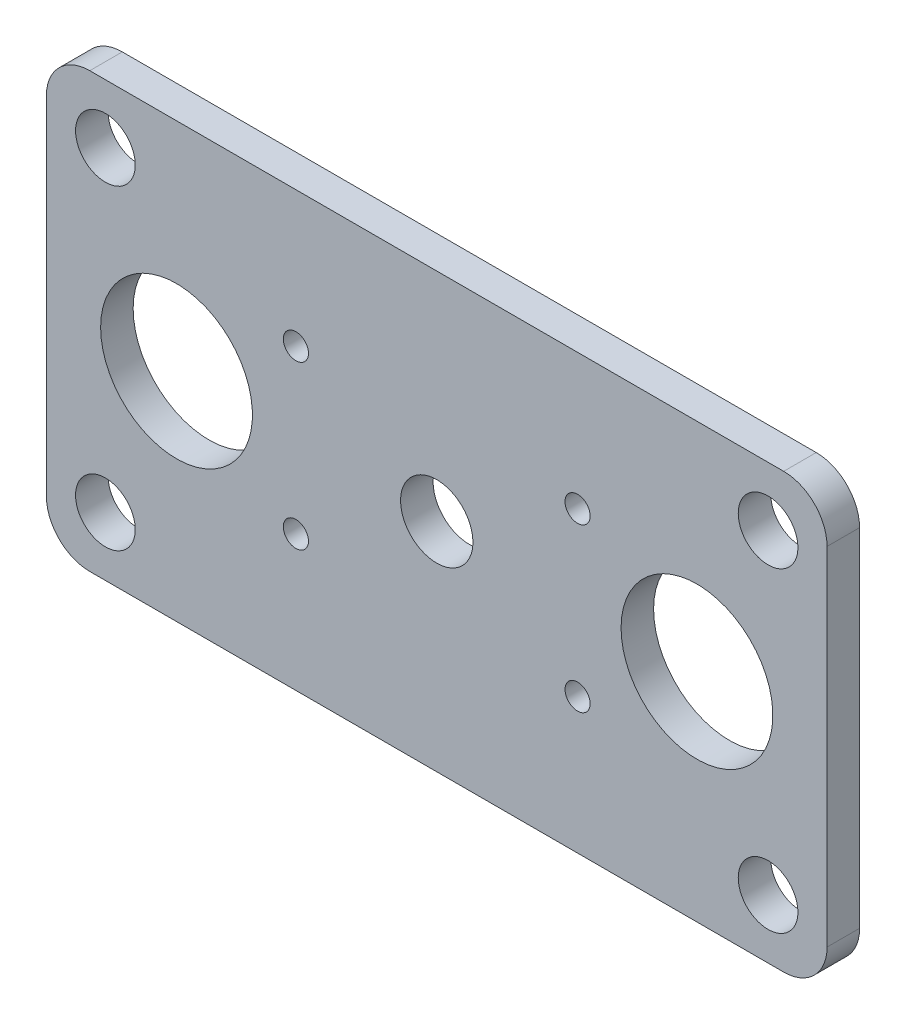
ISO-10303-21;
HEADER;
FILE_DESCRIPTION(('STEP AP214'),'2;1');
FILE_NAME('part.step','',(''),(''),'','','');
FILE_SCHEMA(('AUTOMOTIVE_DESIGN { 1 0 10303 214 1 1 1 1 }'));
ENDSEC;
DATA;
#1=APPLICATION_CONTEXT('core data for automotive mechanical design processes');
#2=APPLICATION_PROTOCOL_DEFINITION('international standard','automotive_design',2000,#1);
#3=PRODUCT_CONTEXT('',#1,'mechanical');
#4=PRODUCT('Part','Part','',(#3));
#5=PRODUCT_RELATED_PRODUCT_CATEGORY('part','',(#4));
#6=PRODUCT_DEFINITION_FORMATION('','',#4);
#7=PRODUCT_DEFINITION_CONTEXT('part definition',#1,'design');
#8=PRODUCT_DEFINITION('design','',#6,#7);
#9=PRODUCT_DEFINITION_SHAPE('','',#8);
#10=(LENGTH_UNIT() NAMED_UNIT(*) SI_UNIT(.MILLI.,.METRE.));
#11=(NAMED_UNIT(*) PLANE_ANGLE_UNIT() SI_UNIT($,.RADIAN.));
#12=(NAMED_UNIT(*) SI_UNIT($,.STERADIAN.) SOLID_ANGLE_UNIT());
#13=UNCERTAINTY_MEASURE_WITH_UNIT(LENGTH_MEASURE(1.E-05),#10,'distance_accuracy_value','');
#14=(GEOMETRIC_REPRESENTATION_CONTEXT(3) GLOBAL_UNCERTAINTY_ASSIGNED_CONTEXT((#13)) GLOBAL_UNIT_ASSIGNED_CONTEXT((#10,
#11,#12)) REPRESENTATION_CONTEXT('',''));
#15=CARTESIAN_POINT('',(0.,0.,0.));
#16=DIRECTION('',(0.,0.,1.));
#17=DIRECTION('',(1.,0.,0.));
#18=AXIS2_PLACEMENT_3D('',#15,#16,#17);
#19=CARTESIAN_POINT('',(0.,0.,4.7625));
#20=DIRECTION('',(0.,0.,1.));
#21=DIRECTION('',(1.,0.,0.));
#22=AXIS2_PLACEMENT_3D('',#19,#20,#21);
#23=PLANE('',#22);
#24=CARTESIAN_POINT('',(-20.6222299276169,11.90625,4.7625));
#25=DIRECTION('',(0.,0.,-1.));
#26=DIRECTION('',(-1.,0.,0.));
#27=AXIS2_PLACEMENT_3D('',#24,#25,#26);
#28=CIRCLE('',#27,1.8415);
#29=CARTESIAN_POINT('',(-22.4637299276169,11.90625,4.7625));
#30=VERTEX_POINT('',#29);
#31=EDGE_CURVE('E160',#30,#30,#28,.T.);
#32=ORIENTED_EDGE('',*,*,#31,.T.);
#33=EDGE_LOOP('',(#32));
#34=FACE_BOUND('',#33,.T.);
#35=CARTESIAN_POINT('',(-20.6222299276169,-11.90625,4.7625));
#36=DIRECTION('',(0.,0.,-1.));
#37=DIRECTION('',(-1.,0.,0.));
#38=AXIS2_PLACEMENT_3D('',#35,#36,#37);
#39=CIRCLE('',#38,1.8415);
#40=CARTESIAN_POINT('',(-22.4637299276169,-11.90625,4.7625));
#41=VERTEX_POINT('',#40);
#42=EDGE_CURVE('E163',#41,#41,#39,.T.);
#43=ORIENTED_EDGE('',*,*,#42,.T.);
#44=EDGE_LOOP('',(#43));
#45=FACE_BOUND('',#44,.T.);
#46=CARTESIAN_POINT('',(20.6222299276169,-11.90625,4.7625));
#47=DIRECTION('',(0.,0.,-1.));
#48=DIRECTION('',(-1.,0.,0.));
#49=AXIS2_PLACEMENT_3D('',#46,#47,#48);
#50=CIRCLE('',#49,1.84149999999999);
#51=CARTESIAN_POINT('',(18.780729927617,-11.90625,4.7625));
#52=VERTEX_POINT('',#51);
#53=EDGE_CURVE('E166',#52,#52,#50,.T.);
#54=ORIENTED_EDGE('',*,*,#53,.T.);
#55=EDGE_LOOP('',(#54));
#56=FACE_BOUND('',#55,.T.);
#57=CARTESIAN_POINT('',(20.622229927617,11.90625,4.7625));
#58=DIRECTION('',(0.,0.,-1.));
#59=DIRECTION('',(-1.,0.,0.));
#60=AXIS2_PLACEMENT_3D('',#57,#58,#59);
#61=CIRCLE('',#60,1.8415);
#62=CARTESIAN_POINT('',(18.780729927617,11.90625,4.7625));
#63=VERTEX_POINT('',#62);
#64=EDGE_CURVE('E169',#63,#63,#61,.T.);
#65=ORIENTED_EDGE('',*,*,#64,.T.);
#66=EDGE_LOOP('',(#65));
#67=FACE_BOUND('',#66,.T.);
#68=CARTESIAN_POINT('',(-38.1,0.,4.7625));
#69=DIRECTION('',(0.,0.,-1.));
#70=DIRECTION('',(-1.,0.,0.));
#71=AXIS2_PLACEMENT_3D('',#68,#69,#70);
#72=CIRCLE('',#71,11.1125);
#73=CARTESIAN_POINT('',(-49.2125,0.,4.7625));
#74=VERTEX_POINT('',#73);
#75=EDGE_CURVE('E172',#74,#74,#72,.T.);
#76=ORIENTED_EDGE('',*,*,#75,.T.);
#77=EDGE_LOOP('',(#76));
#78=FACE_BOUND('',#77,.T.);
#79=CARTESIAN_POINT('',(38.1,0.,4.7625));
#80=DIRECTION('',(0.,0.,-1.));
#81=DIRECTION('',(-1.,0.,0.));
#82=AXIS2_PLACEMENT_3D('',#79,#80,#81);
#83=CIRCLE('',#82,11.1125);
#84=CARTESIAN_POINT('',(26.9875,0.,4.7625));
#85=VERTEX_POINT('',#84);
#86=EDGE_CURVE('E175',#85,#85,#83,.T.);
#87=ORIENTED_EDGE('',*,*,#86,.T.);
#88=EDGE_LOOP('',(#87));
#89=FACE_BOUND('',#88,.T.);
#90=CARTESIAN_POINT('',(48.514,-23.1140000000001,4.7625));
#91=DIRECTION('',(0.,0.,-1.));
#92=DIRECTION('',(-1.,0.,0.));
#93=AXIS2_PLACEMENT_3D('',#90,#91,#92);
#94=CIRCLE('',#93,4.36880000000001);
#95=CARTESIAN_POINT('',(44.1452,-23.1140000000001,4.7625));
#96=VERTEX_POINT('',#95);
#97=EDGE_CURVE('E178',#96,#96,#94,.T.);
#98=ORIENTED_EDGE('',*,*,#97,.T.);
#99=EDGE_LOOP('',(#98));
#100=FACE_BOUND('',#99,.T.);
#101=CARTESIAN_POINT('',(48.514,23.1140000000001,4.7625));
#102=DIRECTION('',(0.,0.,-1.));
#103=DIRECTION('',(-1.,0.,0.));
#104=AXIS2_PLACEMENT_3D('',#101,#102,#103);
#105=CIRCLE('',#104,4.3688);
#106=CARTESIAN_POINT('',(44.1452,23.1140000000001,4.7625));
#107=VERTEX_POINT('',#106);
#108=EDGE_CURVE('E181',#107,#107,#105,.T.);
#109=ORIENTED_EDGE('',*,*,#108,.T.);
#110=EDGE_LOOP('',(#109));
#111=FACE_BOUND('',#110,.T.);
#112=CARTESIAN_POINT('',(-48.514,-23.114,4.7625));
#113=DIRECTION('',(0.,0.,-1.));
#114=DIRECTION('',(-1.,0.,0.));
#115=AXIS2_PLACEMENT_3D('',#112,#113,#114);
#116=CIRCLE('',#115,4.3688);
#117=CARTESIAN_POINT('',(-52.8828,-23.114,4.7625));
#118=VERTEX_POINT('',#117);
#119=EDGE_CURVE('E184',#118,#118,#116,.T.);
#120=ORIENTED_EDGE('',*,*,#119,.T.);
#121=EDGE_LOOP('',(#120));
#122=FACE_BOUND('',#121,.T.);
#123=CARTESIAN_POINT('',(-48.514,23.114,4.7625));
#124=DIRECTION('',(0.,0.,-1.));
#125=DIRECTION('',(-1.,0.,0.));
#126=AXIS2_PLACEMENT_3D('',#123,#124,#125);
#127=CIRCLE('',#126,4.36880000000001);
#128=CARTESIAN_POINT('',(-52.8828,23.114,4.7625));
#129=VERTEX_POINT('',#128);
#130=EDGE_CURVE('E187',#129,#129,#127,.T.);
#131=ORIENTED_EDGE('',*,*,#130,.T.);
#132=EDGE_LOOP('',(#131));
#133=FACE_BOUND('',#132,.T.);
#134=CARTESIAN_POINT('',(0.,0.,4.7625));
#135=DIRECTION('',(0.,0.,-1.));
#136=DIRECTION('',(-1.,0.,0.));
#137=AXIS2_PLACEMENT_3D('',#134,#135,#136);
#138=CIRCLE('',#137,5.2959);
#139=CARTESIAN_POINT('',(-5.2959,0.,4.7625));
#140=VERTEX_POINT('',#139);
#141=EDGE_CURVE('E190',#140,#140,#138,.T.);
#142=ORIENTED_EDGE('',*,*,#141,.T.);
#143=EDGE_LOOP('',(#142));
#144=FACE_BOUND('',#143,.T.);
#145=DIRECTION('',(0.,1.,0.));
#146=VECTOR('',#145,1.);
#147=CARTESIAN_POINT('',(57.15,25.4,4.7625));
#148=LINE('',#147,#146);
#149=CARTESIAN_POINT('',(57.15,25.4,4.7625));
#150=VERTEX_POINT('',#149);
#151=CARTESIAN_POINT('',(57.15,-25.4,4.7625));
#152=VERTEX_POINT('',#151);
#153=EDGE_CURVE('E114',#150,#152,#148,.F.);
#154=ORIENTED_EDGE('',*,*,#153,.F.);
#155=CARTESIAN_POINT('',(50.8,25.4,4.7625));
#156=DIRECTION('',(0.,0.,1.));
#157=DIRECTION('',(1.,0.,0.));
#158=AXIS2_PLACEMENT_3D('',#155,#156,#157);
#159=CIRCLE('',#158,6.35);
#160=CARTESIAN_POINT('',(50.8,31.75,4.7625));
#161=VERTEX_POINT('',#160);
#162=EDGE_CURVE('E195',#161,#150,#159,.F.);
#163=ORIENTED_EDGE('',*,*,#162,.F.);
#164=DIRECTION('',(1.,0.,0.));
#165=VECTOR('',#164,1.);
#166=CARTESIAN_POINT('',(21.0605674187569,31.75,4.7625));
#167=LINE('',#166,#165);
#168=CARTESIAN_POINT('',(-50.8,31.75,4.7625));
#169=VERTEX_POINT('',#168);
#170=EDGE_CURVE('E110',#169,#161,#167,.T.);
#171=ORIENTED_EDGE('',*,*,#170,.F.);
#172=CARTESIAN_POINT('',(-50.8,25.4,4.7625));
#173=DIRECTION('',(0.,0.,1.));
#174=DIRECTION('',(1.,0.,0.));
#175=AXIS2_PLACEMENT_3D('',#172,#173,#174);
#176=CIRCLE('',#175,6.35);
#177=CARTESIAN_POINT('',(-57.15,25.4,4.7625));
#178=VERTEX_POINT('',#177);
#179=EDGE_CURVE('E97',#178,#169,#176,.F.);
#180=ORIENTED_EDGE('',*,*,#179,.F.);
#181=DIRECTION('',(0.,1.,0.));
#182=VECTOR('',#181,1.);
#183=CARTESIAN_POINT('',(-57.15,-25.4,4.7625));
#184=LINE('',#183,#182);
#185=CARTESIAN_POINT('',(-57.15,-25.4,4.7625));
#186=VERTEX_POINT('',#185);
#187=EDGE_CURVE('E93',#186,#178,#184,.T.);
#188=ORIENTED_EDGE('',*,*,#187,.F.);
#189=CARTESIAN_POINT('',(-50.8,-25.4,4.7625));
#190=DIRECTION('',(0.,0.,1.));
#191=DIRECTION('',(1.,0.,0.));
#192=AXIS2_PLACEMENT_3D('',#189,#190,#191);
#193=CIRCLE('',#192,6.35);
#194=CARTESIAN_POINT('',(-50.8,-31.7500000000001,4.7625));
#195=VERTEX_POINT('',#194);
#196=EDGE_CURVE('E21',#195,#186,#193,.F.);
#197=ORIENTED_EDGE('',*,*,#196,.F.);
#198=DIRECTION('',(1.,0.,0.));
#199=VECTOR('',#198,1.);
#200=CARTESIAN_POINT('',(21.0605674187567,-31.7500000000001,4.7625));
#201=LINE('',#200,#199);
#202=CARTESIAN_POINT('',(50.8,-31.75,4.7625));
#203=VERTEX_POINT('',#202);
#204=EDGE_CURVE('E80',#203,#195,#201,.F.);
#205=ORIENTED_EDGE('',*,*,#204,.F.);
#206=CARTESIAN_POINT('',(50.8,-25.4,4.7625));
#207=DIRECTION('',(0.,0.,1.));
#208=DIRECTION('',(1.,0.,0.));
#209=AXIS2_PLACEMENT_3D('',#206,#207,#208);
#210=CIRCLE('',#209,6.35);
#211=EDGE_CURVE('E196',#152,#203,#210,.F.);
#212=ORIENTED_EDGE('',*,*,#211,.F.);
#213=EDGE_LOOP('',(#154,#163,#171,#180,#188,#197,#205,#212));
#214=FACE_BOUND('',#213,.T.);
#215=ADVANCED_FACE('F17',(#34,#45,#56,#67,#78,#89,#100,#111,#122,#133,#144,#214),#23,.T.);
#216=CARTESIAN_POINT('',(-57.15,-25.4,0.));
#217=DIRECTION('',(-1.,0.,0.));
#218=DIRECTION('',(0.,0.,1.));
#219=AXIS2_PLACEMENT_3D('',#216,#217,#218);
#220=PLANE('',#219);
#221=DIRECTION('',(0.,1.,0.));
#222=VECTOR('',#221,1.);
#223=CARTESIAN_POINT('',(-57.15,0.,0.));
#224=LINE('',#223,#222);
#225=CARTESIAN_POINT('',(-57.15,25.4,0.));
#226=VERTEX_POINT('',#225);
#227=CARTESIAN_POINT('',(-57.15,-25.4,0.));
#228=VERTEX_POINT('',#227);
#229=EDGE_CURVE('E104',#226,#228,#224,.F.);
#230=ORIENTED_EDGE('',*,*,#229,.T.);
#231=DIRECTION('',(0.,0.,1.));
#232=VECTOR('',#231,1.);
#233=CARTESIAN_POINT('',(-57.15,-25.4,0.));
#234=LINE('',#233,#232);
#235=EDGE_CURVE('E89',#186,#228,#234,.F.);
#236=ORIENTED_EDGE('',*,*,#235,.F.);
#237=ORIENTED_EDGE('',*,*,#187,.T.);
#238=DIRECTION('',(0.,0.,1.));
#239=VECTOR('',#238,1.);
#240=CARTESIAN_POINT('',(-57.15,25.4,0.));
#241=LINE('',#240,#239);
#242=EDGE_CURVE('E193',#226,#178,#241,.T.);
#243=ORIENTED_EDGE('',*,*,#242,.F.);
#244=EDGE_LOOP('',(#230,#236,#237,#243));
#245=FACE_BOUND('',#244,.T.);
#246=ADVANCED_FACE('F103',(#245),#220,.T.);
#247=CARTESIAN_POINT('',(-50.8,-25.4,0.));
#248=DIRECTION('',(0.,0.,1.));
#249=DIRECTION('',(1.,0.,0.));
#250=AXIS2_PLACEMENT_3D('',#247,#248,#249);
#251=CYLINDRICAL_SURFACE('',#250,6.35);
#252=CARTESIAN_POINT('',(-50.8,-25.4,0.));
#253=DIRECTION('',(0.,0.,1.));
#254=DIRECTION('',(1.,0.,0.));
#255=AXIS2_PLACEMENT_3D('',#252,#253,#254);
#256=CIRCLE('',#255,6.35);
#257=CARTESIAN_POINT('',(-50.8,-31.75,0.));
#258=VERTEX_POINT('',#257);
#259=EDGE_CURVE('E158',#228,#258,#256,.T.);
#260=ORIENTED_EDGE('',*,*,#259,.T.);
#261=DIRECTION('',(0.,0.,-1.));
#262=VECTOR('',#261,1.);
#263=CARTESIAN_POINT('',(-50.8,-31.7500000000001,0.));
#264=LINE('',#263,#262);
#265=EDGE_CURVE('E91',#195,#258,#264,.T.);
#266=ORIENTED_EDGE('',*,*,#265,.F.);
#267=ORIENTED_EDGE('',*,*,#196,.T.);
#268=ORIENTED_EDGE('',*,*,#235,.T.);
#269=EDGE_LOOP('',(#260,#266,#267,#268));
#270=FACE_BOUND('',#269,.T.);
#271=ADVANCED_FACE('F87',(#270),#251,.T.);
#272=CARTESIAN_POINT('',(21.0605674187567,-31.7500000000001,0.));
#273=DIRECTION('',(0.,-1.,0.));
#274=DIRECTION('',(0.,0.,-1.));
#275=AXIS2_PLACEMENT_3D('',#272,#273,#274);
#276=PLANE('',#275);
#277=DIRECTION('',(1.,0.,0.));
#278=VECTOR('',#277,1.);
#279=CARTESIAN_POINT('',(0.,-31.75,0.));
#280=LINE('',#279,#278);
#281=CARTESIAN_POINT('',(50.8,-31.75,0.));
#282=VERTEX_POINT('',#281);
#283=EDGE_CURVE('E157',#258,#282,#280,.T.);
#284=ORIENTED_EDGE('',*,*,#283,.T.);
#285=DIRECTION('',(0.,0.,1.));
#286=VECTOR('',#285,1.);
#287=CARTESIAN_POINT('',(50.8,-31.75,0.));
#288=LINE('',#287,#286);
#289=EDGE_CURVE('E116',#203,#282,#288,.F.);
#290=ORIENTED_EDGE('',*,*,#289,.F.);
#291=ORIENTED_EDGE('',*,*,#204,.T.);
#292=ORIENTED_EDGE('',*,*,#265,.T.);
#293=EDGE_LOOP('',(#284,#290,#291,#292));
#294=FACE_BOUND('',#293,.T.);
#295=ADVANCED_FACE('F202',(#294),#276,.T.);
#296=CARTESIAN_POINT('',(50.8,-25.4,0.));
#297=DIRECTION('',(0.,0.,1.));
#298=DIRECTION('',(1.,0.,0.));
#299=AXIS2_PLACEMENT_3D('',#296,#297,#298);
#300=CYLINDRICAL_SURFACE('',#299,6.35);
#301=CARTESIAN_POINT('',(50.8,-25.4,0.));
#302=DIRECTION('',(0.,0.,1.));
#303=DIRECTION('',(1.,0.,0.));
#304=AXIS2_PLACEMENT_3D('',#301,#302,#303);
#305=CIRCLE('',#304,6.35);
#306=CARTESIAN_POINT('',(57.15,-25.4,0.));
#307=VERTEX_POINT('',#306);
#308=EDGE_CURVE('E154',#282,#307,#305,.T.);
#309=ORIENTED_EDGE('',*,*,#308,.T.);
#310=DIRECTION('',(0.,0.,-1.));
#311=VECTOR('',#310,1.);
#312=CARTESIAN_POINT('',(57.15,-25.4,0.));
#313=LINE('',#312,#311);
#314=EDGE_CURVE('E115',#152,#307,#313,.T.);
#315=ORIENTED_EDGE('',*,*,#314,.F.);
#316=ORIENTED_EDGE('',*,*,#211,.T.);
#317=ORIENTED_EDGE('',*,*,#289,.T.);
#318=EDGE_LOOP('',(#309,#315,#316,#317));
#319=FACE_BOUND('',#318,.T.);
#320=ADVANCED_FACE('F222',(#319),#300,.T.);
#321=CARTESIAN_POINT('',(57.15,25.4,0.));
#322=DIRECTION('',(1.,0.,0.));
#323=DIRECTION('',(0.,0.,-1.));
#324=AXIS2_PLACEMENT_3D('',#321,#322,#323);
#325=PLANE('',#324);
#326=DIRECTION('',(0.,1.,0.));
#327=VECTOR('',#326,1.);
#328=CARTESIAN_POINT('',(57.15,0.,0.));
#329=LINE('',#328,#327);
#330=CARTESIAN_POINT('',(57.15,25.4,0.));
#331=VERTEX_POINT('',#330);
#332=EDGE_CURVE('E153',#307,#331,#329,.T.);
#333=ORIENTED_EDGE('',*,*,#332,.T.);
#334=DIRECTION('',(0.,0.,1.));
#335=VECTOR('',#334,1.);
#336=CARTESIAN_POINT('',(57.15,25.4,0.));
#337=LINE('',#336,#335);
#338=EDGE_CURVE('E113',#150,#331,#337,.F.);
#339=ORIENTED_EDGE('',*,*,#338,.F.);
#340=ORIENTED_EDGE('',*,*,#153,.T.);
#341=ORIENTED_EDGE('',*,*,#314,.T.);
#342=EDGE_LOOP('',(#333,#339,#340,#341));
#343=FACE_BOUND('',#342,.T.);
#344=ADVANCED_FACE('F219',(#343),#325,.T.);
#345=CARTESIAN_POINT('',(50.8,25.4,0.));
#346=DIRECTION('',(0.,0.,1.));
#347=DIRECTION('',(1.,0.,0.));
#348=AXIS2_PLACEMENT_3D('',#345,#346,#347);
#349=CYLINDRICAL_SURFACE('',#348,6.35);
#350=CARTESIAN_POINT('',(50.8,25.4,0.));
#351=DIRECTION('',(0.,0.,1.));
#352=DIRECTION('',(1.,0.,0.));
#353=AXIS2_PLACEMENT_3D('',#350,#351,#352);
#354=CIRCLE('',#353,6.35);
#355=CARTESIAN_POINT('',(50.8,31.75,0.));
#356=VERTEX_POINT('',#355);
#357=EDGE_CURVE('E150',#331,#356,#354,.T.);
#358=ORIENTED_EDGE('',*,*,#357,.T.);
#359=DIRECTION('',(0.,0.,1.));
#360=VECTOR('',#359,1.);
#361=CARTESIAN_POINT('',(50.8,31.75,0.));
#362=LINE('',#361,#360);
#363=EDGE_CURVE('E112',#161,#356,#362,.F.);
#364=ORIENTED_EDGE('',*,*,#363,.F.);
#365=ORIENTED_EDGE('',*,*,#162,.T.);
#366=ORIENTED_EDGE('',*,*,#338,.T.);
#367=EDGE_LOOP('',(#358,#364,#365,#366));
#368=FACE_BOUND('',#367,.T.);
#369=ADVANCED_FACE('F230',(#368),#349,.T.);
#370=CARTESIAN_POINT('',(21.0605674187569,31.75,0.));
#371=DIRECTION('',(0.,1.,0.));
#372=DIRECTION('',(0.,0.,1.));
#373=AXIS2_PLACEMENT_3D('',#370,#371,#372);
#374=PLANE('',#373);
#375=DIRECTION('',(1.,0.,0.));
#376=VECTOR('',#375,1.);
#377=CARTESIAN_POINT('',(0.,31.75,0.));
#378=LINE('',#377,#376);
#379=CARTESIAN_POINT('',(-50.8,31.75,0.));
#380=VERTEX_POINT('',#379);
#381=EDGE_CURVE('E149',#356,#380,#378,.F.);
#382=ORIENTED_EDGE('',*,*,#381,.T.);
#383=DIRECTION('',(0.,0.,1.));
#384=VECTOR('',#383,1.);
#385=CARTESIAN_POINT('',(-50.8,31.75,0.));
#386=LINE('',#385,#384);
#387=EDGE_CURVE('E36',#169,#380,#386,.F.);
#388=ORIENTED_EDGE('',*,*,#387,.F.);
#389=ORIENTED_EDGE('',*,*,#170,.T.);
#390=ORIENTED_EDGE('',*,*,#363,.T.);
#391=EDGE_LOOP('',(#382,#388,#389,#390));
#392=FACE_BOUND('',#391,.T.);
#393=ADVANCED_FACE('F258',(#392),#374,.T.);
#394=CARTESIAN_POINT('',(-50.8,25.4,0.));
#395=DIRECTION('',(0.,0.,1.));
#396=DIRECTION('',(1.,0.,0.));
#397=AXIS2_PLACEMENT_3D('',#394,#395,#396);
#398=CYLINDRICAL_SURFACE('',#397,6.35);
#399=CARTESIAN_POINT('',(-50.8,25.4,0.));
#400=DIRECTION('',(0.,0.,1.));
#401=DIRECTION('',(1.,0.,0.));
#402=AXIS2_PLACEMENT_3D('',#399,#400,#401);
#403=CIRCLE('',#402,6.35);
#404=EDGE_CURVE('E147',#380,#226,#403,.T.);
#405=ORIENTED_EDGE('',*,*,#404,.T.);
#406=ORIENTED_EDGE('',*,*,#242,.T.);
#407=ORIENTED_EDGE('',*,*,#179,.T.);
#408=ORIENTED_EDGE('',*,*,#387,.T.);
#409=EDGE_LOOP('',(#405,#406,#407,#408));
#410=FACE_BOUND('',#409,.T.);
#411=ADVANCED_FACE('F254',(#410),#398,.T.);
#412=CARTESIAN_POINT('',(0.,0.,4.7625));
#413=DIRECTION('',(0.,0.,-1.));
#414=DIRECTION('',(-1.,0.,0.));
#415=AXIS2_PLACEMENT_3D('',#412,#413,#414);
#416=CYLINDRICAL_SURFACE('',#415,5.2959);
#417=ORIENTED_EDGE('',*,*,#141,.F.);
#418=EDGE_LOOP('',(#417));
#419=FACE_BOUND('',#418,.T.);
#420=CARTESIAN_POINT('',(0.,0.,0.));
#421=DIRECTION('',(0.,0.,-1.));
#422=DIRECTION('',(-1.,0.,0.));
#423=AXIS2_PLACEMENT_3D('',#420,#421,#422);
#424=CIRCLE('',#423,5.2959);
#425=CARTESIAN_POINT('',(-5.2959,0.,0.));
#426=VERTEX_POINT('',#425);
#427=EDGE_CURVE('E144',#426,#426,#424,.T.);
#428=ORIENTED_EDGE('',*,*,#427,.T.);
#429=EDGE_LOOP('',(#428));
#430=FACE_BOUND('',#429,.T.);
#431=ADVANCED_FACE('F257',(#419,#430),#416,.F.);
#432=CARTESIAN_POINT('',(-48.514,23.114,4.7625));
#433=DIRECTION('',(0.,0.,-1.));
#434=DIRECTION('',(-1.,0.,0.));
#435=AXIS2_PLACEMENT_3D('',#432,#433,#434);
#436=CYLINDRICAL_SURFACE('',#435,4.36880000000001);
#437=ORIENTED_EDGE('',*,*,#130,.F.);
#438=EDGE_LOOP('',(#437));
#439=FACE_BOUND('',#438,.T.);
#440=CARTESIAN_POINT('',(-48.514,23.114,0.));
#441=DIRECTION('',(0.,0.,-1.));
#442=DIRECTION('',(-1.,0.,0.));
#443=AXIS2_PLACEMENT_3D('',#440,#441,#442);
#444=CIRCLE('',#443,4.36880000000001);
#445=CARTESIAN_POINT('',(-52.8828,23.114,0.));
#446=VERTEX_POINT('',#445);
#447=EDGE_CURVE('E141',#446,#446,#444,.T.);
#448=ORIENTED_EDGE('',*,*,#447,.T.);
#449=EDGE_LOOP('',(#448));
#450=FACE_BOUND('',#449,.T.);
#451=ADVANCED_FACE('F287',(#439,#450),#436,.F.);
#452=CARTESIAN_POINT('',(-48.514,-23.114,4.7625));
#453=DIRECTION('',(0.,0.,-1.));
#454=DIRECTION('',(-1.,0.,0.));
#455=AXIS2_PLACEMENT_3D('',#452,#453,#454);
#456=CYLINDRICAL_SURFACE('',#455,4.3688);
#457=ORIENTED_EDGE('',*,*,#119,.F.);
#458=EDGE_LOOP('',(#457));
#459=FACE_BOUND('',#458,.T.);
#460=CARTESIAN_POINT('',(-48.514,-23.114,0.));
#461=DIRECTION('',(0.,0.,-1.));
#462=DIRECTION('',(-1.,0.,0.));
#463=AXIS2_PLACEMENT_3D('',#460,#461,#462);
#464=CIRCLE('',#463,4.3688);
#465=CARTESIAN_POINT('',(-52.8828,-23.114,0.));
#466=VERTEX_POINT('',#465);
#467=EDGE_CURVE('E138',#466,#466,#464,.T.);
#468=ORIENTED_EDGE('',*,*,#467,.T.);
#469=EDGE_LOOP('',(#468));
#470=FACE_BOUND('',#469,.T.);
#471=ADVANCED_FACE('F295',(#459,#470),#456,.F.);
#472=CARTESIAN_POINT('',(48.514,23.1140000000001,4.7625));
#473=DIRECTION('',(0.,0.,-1.));
#474=DIRECTION('',(-1.,0.,0.));
#475=AXIS2_PLACEMENT_3D('',#472,#473,#474);
#476=CYLINDRICAL_SURFACE('',#475,4.3688);
#477=ORIENTED_EDGE('',*,*,#108,.F.);
#478=EDGE_LOOP('',(#477));
#479=FACE_BOUND('',#478,.T.);
#480=CARTESIAN_POINT('',(48.514,23.1140000000001,0.));
#481=DIRECTION('',(0.,0.,-1.));
#482=DIRECTION('',(-1.,0.,0.));
#483=AXIS2_PLACEMENT_3D('',#480,#481,#482);
#484=CIRCLE('',#483,4.3688);
#485=CARTESIAN_POINT('',(44.1452,23.1140000000001,0.));
#486=VERTEX_POINT('',#485);
#487=EDGE_CURVE('E135',#486,#486,#484,.T.);
#488=ORIENTED_EDGE('',*,*,#487,.T.);
#489=EDGE_LOOP('',(#488));
#490=FACE_BOUND('',#489,.T.);
#491=ADVANCED_FACE('F303',(#479,#490),#476,.F.);
#492=CARTESIAN_POINT('',(48.514,-23.1140000000001,4.7625));
#493=DIRECTION('',(0.,0.,-1.));
#494=DIRECTION('',(-1.,0.,0.));
#495=AXIS2_PLACEMENT_3D('',#492,#493,#494);
#496=CYLINDRICAL_SURFACE('',#495,4.36880000000001);
#497=ORIENTED_EDGE('',*,*,#97,.F.);
#498=EDGE_LOOP('',(#497));
#499=FACE_BOUND('',#498,.T.);
#500=CARTESIAN_POINT('',(48.514,-23.1140000000001,0.));
#501=DIRECTION('',(0.,0.,-1.));
#502=DIRECTION('',(-1.,0.,0.));
#503=AXIS2_PLACEMENT_3D('',#500,#501,#502);
#504=CIRCLE('',#503,4.36880000000001);
#505=CARTESIAN_POINT('',(44.1452,-23.1140000000001,0.));
#506=VERTEX_POINT('',#505);
#507=EDGE_CURVE('E132',#506,#506,#504,.T.);
#508=ORIENTED_EDGE('',*,*,#507,.T.);
#509=EDGE_LOOP('',(#508));
#510=FACE_BOUND('',#509,.T.);
#511=ADVANCED_FACE('F252',(#499,#510),#496,.F.);
#512=CARTESIAN_POINT('',(38.1,0.,4.7625));
#513=DIRECTION('',(0.,0.,-1.));
#514=DIRECTION('',(-1.,0.,0.));
#515=AXIS2_PLACEMENT_3D('',#512,#513,#514);
#516=CYLINDRICAL_SURFACE('',#515,11.1125);
#517=ORIENTED_EDGE('',*,*,#86,.F.);
#518=EDGE_LOOP('',(#517));
#519=FACE_BOUND('',#518,.T.);
#520=CARTESIAN_POINT('',(38.1,0.,0.));
#521=DIRECTION('',(0.,0.,-1.));
#522=DIRECTION('',(-1.,0.,0.));
#523=AXIS2_PLACEMENT_3D('',#520,#521,#522);
#524=CIRCLE('',#523,11.1125);
#525=CARTESIAN_POINT('',(26.9875,0.,0.));
#526=VERTEX_POINT('',#525);
#527=EDGE_CURVE('E129',#526,#526,#524,.T.);
#528=ORIENTED_EDGE('',*,*,#527,.T.);
#529=EDGE_LOOP('',(#528));
#530=FACE_BOUND('',#529,.T.);
#531=ADVANCED_FACE('F248',(#519,#530),#516,.F.);
#532=CARTESIAN_POINT('',(-38.1,0.,4.7625));
#533=DIRECTION('',(0.,0.,-1.));
#534=DIRECTION('',(-1.,0.,0.));
#535=AXIS2_PLACEMENT_3D('',#532,#533,#534);
#536=CYLINDRICAL_SURFACE('',#535,11.1125);
#537=ORIENTED_EDGE('',*,*,#75,.F.);
#538=EDGE_LOOP('',(#537));
#539=FACE_BOUND('',#538,.T.);
#540=CARTESIAN_POINT('',(-38.1,0.,0.));
#541=DIRECTION('',(0.,0.,-1.));
#542=DIRECTION('',(-1.,0.,0.));
#543=AXIS2_PLACEMENT_3D('',#540,#541,#542);
#544=CIRCLE('',#543,11.1125);
#545=CARTESIAN_POINT('',(-49.2125,0.,0.));
#546=VERTEX_POINT('',#545);
#547=EDGE_CURVE('E126',#546,#546,#544,.T.);
#548=ORIENTED_EDGE('',*,*,#547,.T.);
#549=EDGE_LOOP('',(#548));
#550=FACE_BOUND('',#549,.T.);
#551=ADVANCED_FACE('F244',(#539,#550),#536,.F.);
#552=CARTESIAN_POINT('',(20.622229927617,11.90625,4.7625));
#553=DIRECTION('',(0.,0.,-1.));
#554=DIRECTION('',(-1.,0.,0.));
#555=AXIS2_PLACEMENT_3D('',#552,#553,#554);
#556=CYLINDRICAL_SURFACE('',#555,1.8415);
#557=ORIENTED_EDGE('',*,*,#64,.F.);
#558=EDGE_LOOP('',(#557));
#559=FACE_BOUND('',#558,.T.);
#560=CARTESIAN_POINT('',(20.622229927617,11.90625,0.));
#561=DIRECTION('',(0.,0.,-1.));
#562=DIRECTION('',(-1.,0.,0.));
#563=AXIS2_PLACEMENT_3D('',#560,#561,#562);
#564=CIRCLE('',#563,1.8415);
#565=CARTESIAN_POINT('',(18.780729927617,11.90625,0.));
#566=VERTEX_POINT('',#565);
#567=EDGE_CURVE('E123',#566,#566,#564,.T.);
#568=ORIENTED_EDGE('',*,*,#567,.T.);
#569=EDGE_LOOP('',(#568));
#570=FACE_BOUND('',#569,.T.);
#571=ADVANCED_FACE('F247',(#559,#570),#556,.F.);
#572=CARTESIAN_POINT('',(20.6222299276169,-11.90625,4.7625));
#573=DIRECTION('',(0.,0.,-1.));
#574=DIRECTION('',(-1.,0.,0.));
#575=AXIS2_PLACEMENT_3D('',#572,#573,#574);
#576=CYLINDRICAL_SURFACE('',#575,1.84149999999999);
#577=ORIENTED_EDGE('',*,*,#53,.F.);
#578=EDGE_LOOP('',(#577));
#579=FACE_BOUND('',#578,.T.);
#580=CARTESIAN_POINT('',(20.6222299276169,-11.90625,0.));
#581=DIRECTION('',(0.,0.,-1.));
#582=DIRECTION('',(-1.,0.,0.));
#583=AXIS2_PLACEMENT_3D('',#580,#581,#582);
#584=CIRCLE('',#583,1.84149999999999);
#585=CARTESIAN_POINT('',(18.780729927617,-11.90625,0.));
#586=VERTEX_POINT('',#585);
#587=EDGE_CURVE('E120',#586,#586,#584,.T.);
#588=ORIENTED_EDGE('',*,*,#587,.T.);
#589=EDGE_LOOP('',(#588));
#590=FACE_BOUND('',#589,.T.);
#591=ADVANCED_FACE('F333',(#579,#590),#576,.F.);
#592=CARTESIAN_POINT('',(-20.6222299276169,-11.90625,4.7625));
#593=DIRECTION('',(0.,0.,-1.));
#594=DIRECTION('',(-1.,0.,0.));
#595=AXIS2_PLACEMENT_3D('',#592,#593,#594);
#596=CYLINDRICAL_SURFACE('',#595,1.8415);
#597=ORIENTED_EDGE('',*,*,#42,.F.);
#598=EDGE_LOOP('',(#597));
#599=FACE_BOUND('',#598,.T.);
#600=CARTESIAN_POINT('',(-20.6222299276169,-11.90625,0.));
#601=DIRECTION('',(0.,0.,-1.));
#602=DIRECTION('',(-1.,0.,0.));
#603=AXIS2_PLACEMENT_3D('',#600,#601,#602);
#604=CIRCLE('',#603,1.8415);
#605=CARTESIAN_POINT('',(-22.4637299276169,-11.90625,0.));
#606=VERTEX_POINT('',#605);
#607=EDGE_CURVE('E27',#606,#606,#604,.T.);
#608=ORIENTED_EDGE('',*,*,#607,.T.);
#609=EDGE_LOOP('',(#608));
#610=FACE_BOUND('',#609,.T.);
#611=ADVANCED_FACE('F239',(#599,#610),#596,.F.);
#612=CARTESIAN_POINT('',(-20.6222299276169,11.90625,4.7625));
#613=DIRECTION('',(0.,0.,-1.));
#614=DIRECTION('',(-1.,0.,0.));
#615=AXIS2_PLACEMENT_3D('',#612,#613,#614);
#616=CYLINDRICAL_SURFACE('',#615,1.8415);
#617=ORIENTED_EDGE('',*,*,#31,.F.);
#618=EDGE_LOOP('',(#617));
#619=FACE_BOUND('',#618,.T.);
#620=CARTESIAN_POINT('',(-20.6222299276169,11.90625,0.));
#621=DIRECTION('',(0.,0.,-1.));
#622=DIRECTION('',(-1.,0.,0.));
#623=AXIS2_PLACEMENT_3D('',#620,#621,#622);
#624=CIRCLE('',#623,1.8415);
#625=CARTESIAN_POINT('',(-22.4637299276169,11.90625,0.));
#626=VERTEX_POINT('',#625);
#627=EDGE_CURVE('E11',#626,#626,#624,.T.);
#628=ORIENTED_EDGE('',*,*,#627,.T.);
#629=EDGE_LOOP('',(#628));
#630=FACE_BOUND('',#629,.T.);
#631=ADVANCED_FACE('F19',(#619,#630),#616,.F.);
#632=CARTESIAN_POINT('',(0.,0.,0.));
#633=DIRECTION('',(0.,0.,1.));
#634=DIRECTION('',(1.,0.,0.));
#635=AXIS2_PLACEMENT_3D('',#632,#633,#634);
#636=PLANE('',#635);
#637=ORIENTED_EDGE('',*,*,#627,.F.);
#638=EDGE_LOOP('',(#637));
#639=FACE_BOUND('',#638,.T.);
#640=ORIENTED_EDGE('',*,*,#607,.F.);
#641=EDGE_LOOP('',(#640));
#642=FACE_BOUND('',#641,.T.);
#643=ORIENTED_EDGE('',*,*,#587,.F.);
#644=EDGE_LOOP('',(#643));
#645=FACE_BOUND('',#644,.T.);
#646=ORIENTED_EDGE('',*,*,#567,.F.);
#647=EDGE_LOOP('',(#646));
#648=FACE_BOUND('',#647,.T.);
#649=ORIENTED_EDGE('',*,*,#547,.F.);
#650=EDGE_LOOP('',(#649));
#651=FACE_BOUND('',#650,.T.);
#652=ORIENTED_EDGE('',*,*,#527,.F.);
#653=EDGE_LOOP('',(#652));
#654=FACE_BOUND('',#653,.T.);
#655=ORIENTED_EDGE('',*,*,#507,.F.);
#656=EDGE_LOOP('',(#655));
#657=FACE_BOUND('',#656,.T.);
#658=ORIENTED_EDGE('',*,*,#487,.F.);
#659=EDGE_LOOP('',(#658));
#660=FACE_BOUND('',#659,.T.);
#661=ORIENTED_EDGE('',*,*,#467,.F.);
#662=EDGE_LOOP('',(#661));
#663=FACE_BOUND('',#662,.T.);
#664=ORIENTED_EDGE('',*,*,#447,.F.);
#665=EDGE_LOOP('',(#664));
#666=FACE_BOUND('',#665,.T.);
#667=ORIENTED_EDGE('',*,*,#427,.F.);
#668=EDGE_LOOP('',(#667));
#669=FACE_BOUND('',#668,.T.);
#670=ORIENTED_EDGE('',*,*,#381,.F.);
#671=ORIENTED_EDGE('',*,*,#357,.F.);
#672=ORIENTED_EDGE('',*,*,#332,.F.);
#673=ORIENTED_EDGE('',*,*,#308,.F.);
#674=ORIENTED_EDGE('',*,*,#283,.F.);
#675=ORIENTED_EDGE('',*,*,#259,.F.);
#676=ORIENTED_EDGE('',*,*,#229,.F.);
#677=ORIENTED_EDGE('',*,*,#404,.F.);
#678=EDGE_LOOP('',(#670,#671,#672,#673,#674,#675,#676,#677));
#679=FACE_BOUND('',#678,.T.);
#680=ADVANCED_FACE('F206',(#639,#642,#645,#648,#651,#654,#657,#660,#663,#666,#669,#679),#636,.F.);
#681=CLOSED_SHELL('',(#215,#246,#271,#295,#320,#344,#369,#393,#411,#431,#451,#471,#491,#511,
#531,#551,#571,#591,#611,#631,#680));
#682=MANIFOLD_SOLID_BREP('B1',#681);
#683=ADVANCED_BREP_SHAPE_REPRESENTATION('',(#18,#682),#14);
#684=SHAPE_DEFINITION_REPRESENTATION(#9,#683);
ENDSEC;
END-ISO-10303-21;
